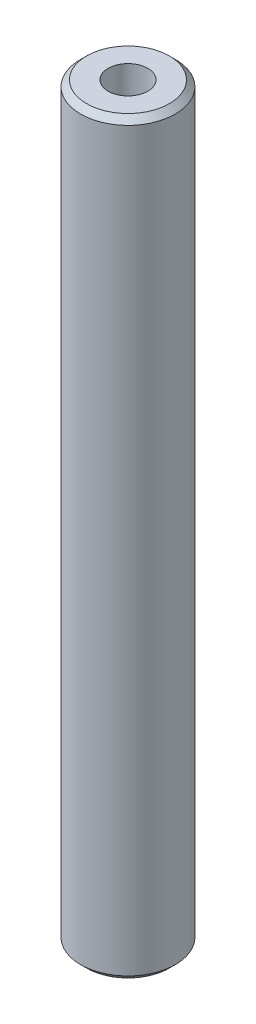
ISO-10303-21;
HEADER;
FILE_DESCRIPTION(('STEP AP214'),'2;1');
FILE_NAME('part.step','',(''),(''),'','','');
FILE_SCHEMA(('AUTOMOTIVE_DESIGN { 1 0 10303 214 1 1 1 1 }'));
ENDSEC;
DATA;
#1=APPLICATION_CONTEXT('core data for automotive mechanical design processes');
#2=APPLICATION_PROTOCOL_DEFINITION('international standard','automotive_design',2000,#1);
#3=PRODUCT_CONTEXT('',#1,'mechanical');
#4=PRODUCT('Part','Part','',(#3));
#5=PRODUCT_RELATED_PRODUCT_CATEGORY('part','',(#4));
#6=PRODUCT_DEFINITION_FORMATION('','',#4);
#7=PRODUCT_DEFINITION_CONTEXT('part definition',#1,'design');
#8=PRODUCT_DEFINITION('design','',#6,#7);
#9=PRODUCT_DEFINITION_SHAPE('','',#8);
#10=(LENGTH_UNIT() NAMED_UNIT(*) SI_UNIT(.MILLI.,.METRE.));
#11=(NAMED_UNIT(*) PLANE_ANGLE_UNIT() SI_UNIT($,.RADIAN.));
#12=(NAMED_UNIT(*) SI_UNIT($,.STERADIAN.) SOLID_ANGLE_UNIT());
#13=UNCERTAINTY_MEASURE_WITH_UNIT(LENGTH_MEASURE(1.E-05),#10,'distance_accuracy_value','');
#14=(GEOMETRIC_REPRESENTATION_CONTEXT(3) GLOBAL_UNCERTAINTY_ASSIGNED_CONTEXT((#13)) GLOBAL_UNIT_ASSIGNED_CONTEXT((#10,
#11,#12)) REPRESENTATION_CONTEXT('',''));
#15=CARTESIAN_POINT('',(0.,0.,0.));
#16=DIRECTION('',(0.,0.,1.));
#17=DIRECTION('',(1.,0.,0.));
#18=AXIS2_PLACEMENT_3D('',#15,#16,#17);
#19=CARTESIAN_POINT('',(0.,237.073214667465,0.));
#20=DIRECTION('',(0.,-1.,0.));
#21=DIRECTION('',(0.,0.,-1.));
#22=AXIS2_PLACEMENT_3D('',#19,#20,#21);
#23=CYLINDRICAL_SURFACE('',#22,15.);
#24=CARTESIAN_POINT('',(0.,235.173893949152,0.));
#25=DIRECTION('',(0.,1.,0.));
#26=DIRECTION('',(0.,0.,1.));
#27=AXIS2_PLACEMENT_3D('',#24,#25,#26);
#28=CIRCLE('',#27,15.);
#29=CARTESIAN_POINT('',(0.,235.173893949152,15.));
#30=VERTEX_POINT('',#29);
#31=EDGE_CURVE('E50',#30,#30,#28,.F.);
#32=ORIENTED_EDGE('',*,*,#31,.T.);
#33=EDGE_LOOP('',(#32));
#34=FACE_BOUND('',#33,.T.);
#35=CARTESIAN_POINT('',(0.,1.89932071831347,0.));
#36=DIRECTION('',(0.,1.,0.));
#37=DIRECTION('',(0.,0.,1.));
#38=AXIS2_PLACEMENT_3D('',#35,#36,#37);
#39=CIRCLE('',#38,15.);
#40=CARTESIAN_POINT('',(0.,1.89932071831347,15.));
#41=VERTEX_POINT('',#40);
#42=EDGE_CURVE('E51',#41,#41,#39,.T.);
#43=ORIENTED_EDGE('',*,*,#42,.T.);
#44=EDGE_LOOP('',(#43));
#45=FACE_BOUND('',#44,.T.);
#46=ADVANCED_FACE('F39',(#34,#45),#23,.T.);
#47=CARTESIAN_POINT('',(0.,237.073214667465,0.));
#48=DIRECTION('',(0.,1.,0.));
#49=DIRECTION('',(0.,0.,1.));
#50=AXIS2_PLACEMENT_3D('',#47,#48,#49);
#51=PLANE('',#50);
#52=CARTESIAN_POINT('',(0.,237.073214667465,0.));
#53=DIRECTION('',(0.,1.,0.));
#54=DIRECTION('',(0.,0.,1.));
#55=AXIS2_PLACEMENT_3D('',#52,#53,#54);
#56=CIRCLE('',#55,13.1006792816865);
#57=CARTESIAN_POINT('',(0.,237.073214667465,13.1006792816865));
#58=VERTEX_POINT('',#57);
#59=EDGE_CURVE('E54',#58,#58,#56,.T.);
#60=ORIENTED_EDGE('',*,*,#59,.T.);
#61=EDGE_LOOP('',(#60));
#62=FACE_BOUND('',#61,.T.);
#63=CARTESIAN_POINT('',(0.,237.073214667465,0.));
#64=DIRECTION('',(0.,1.,0.));
#65=DIRECTION('',(0.,0.,1.));
#66=AXIS2_PLACEMENT_3D('',#63,#64,#65);
#67=CIRCLE('',#66,6.28346109806121);
#68=CARTESIAN_POINT('',(0.,237.073214667465,6.28346109806121));
#69=VERTEX_POINT('',#68);
#70=EDGE_CURVE('E58',#69,#69,#67,.T.);
#71=ORIENTED_EDGE('',*,*,#70,.F.);
#72=EDGE_LOOP('',(#71));
#73=FACE_BOUND('',#72,.T.);
#74=ADVANCED_FACE('F69',(#62,#73),#51,.T.);
#75=CARTESIAN_POINT('',(0.,0.,0.));
#76=DIRECTION('',(0.,1.,0.));
#77=DIRECTION('',(0.,0.,1.));
#78=AXIS2_PLACEMENT_3D('',#75,#76,#77);
#79=PLANE('',#78);
#80=CARTESIAN_POINT('',(0.,0.,0.));
#81=DIRECTION('',(0.,1.,0.));
#82=DIRECTION('',(0.,0.,1.));
#83=AXIS2_PLACEMENT_3D('',#80,#81,#82);
#84=CIRCLE('',#83,13.1006792816865);
#85=CARTESIAN_POINT('',(0.,0.,13.1006792816865));
#86=VERTEX_POINT('',#85);
#87=EDGE_CURVE('E10',#86,#86,#84,.F.);
#88=ORIENTED_EDGE('',*,*,#87,.T.);
#89=EDGE_LOOP('',(#88));
#90=FACE_BOUND('',#89,.T.);
#91=CARTESIAN_POINT('',(0.,0.,0.));
#92=DIRECTION('',(0.,1.,0.));
#93=DIRECTION('',(0.,0.,1.));
#94=AXIS2_PLACEMENT_3D('',#91,#92,#93);
#95=CIRCLE('',#94,6.28346109806121);
#96=CARTESIAN_POINT('',(0.,0.,6.28346109806121));
#97=VERTEX_POINT('',#96);
#98=EDGE_CURVE('E63',#97,#97,#95,.T.);
#99=ORIENTED_EDGE('',*,*,#98,.T.);
#100=EDGE_LOOP('',(#99));
#101=FACE_BOUND('',#100,.T.);
#102=ADVANCED_FACE('F75',(#90,#101),#79,.F.);
#103=CARTESIAN_POINT('',(0.,237.073214667465,0.));
#104=DIRECTION('',(0.,-1.,0.));
#105=DIRECTION('',(0.,0.,-1.));
#106=AXIS2_PLACEMENT_3D('',#103,#104,#105);
#107=CYLINDRICAL_SURFACE('',#106,6.28346109806121);
#108=ORIENTED_EDGE('',*,*,#70,.T.);
#109=EDGE_LOOP('',(#108));
#110=FACE_BOUND('',#109,.T.);
#111=ORIENTED_EDGE('',*,*,#98,.F.);
#112=EDGE_LOOP('',(#111));
#113=FACE_BOUND('',#112,.T.);
#114=ADVANCED_FACE('F70',(#110,#113),#107,.F.);
#115=CARTESIAN_POINT('',(0.,237.073214667465,0.));
#116=DIRECTION('',(0.,-1.,0.));
#117=DIRECTION('',(0.,0.,-1.));
#118=AXIS2_PLACEMENT_3D('',#115,#116,#117);
#119=CONICAL_SURFACE('',#118,13.1006792816865,0.785398163397452);
#120=ORIENTED_EDGE('',*,*,#31,.F.);
#121=EDGE_LOOP('',(#120));
#122=FACE_BOUND('',#121,.T.);
#123=ORIENTED_EDGE('',*,*,#59,.F.);
#124=EDGE_LOOP('',(#123));
#125=FACE_BOUND('',#124,.T.);
#126=ADVANCED_FACE('F81',(#122,#125),#119,.T.);
#127=CARTESIAN_POINT('',(0.,1.89932071831347,0.));
#128=DIRECTION('',(0.,1.,0.));
#129=DIRECTION('',(0.,0.,1.));
#130=AXIS2_PLACEMENT_3D('',#127,#128,#129);
#131=CONICAL_SURFACE('',#130,15.,0.785398163397445);
#132=ORIENTED_EDGE('',*,*,#87,.F.);
#133=EDGE_LOOP('',(#132));
#134=FACE_BOUND('',#133,.T.);
#135=ORIENTED_EDGE('',*,*,#42,.F.);
#136=EDGE_LOOP('',(#135));
#137=FACE_BOUND('',#136,.T.);
#138=ADVANCED_FACE('F45',(#134,#137),#131,.T.);
#139=CLOSED_SHELL('',(#46,#74,#102,#114,#126,#138));
#140=MANIFOLD_SOLID_BREP('B2',#139);
#141=ADVANCED_BREP_SHAPE_REPRESENTATION('',(#18,#140),#14);
#142=SHAPE_DEFINITION_REPRESENTATION(#9,#141);
ENDSEC;
END-ISO-10303-21;
